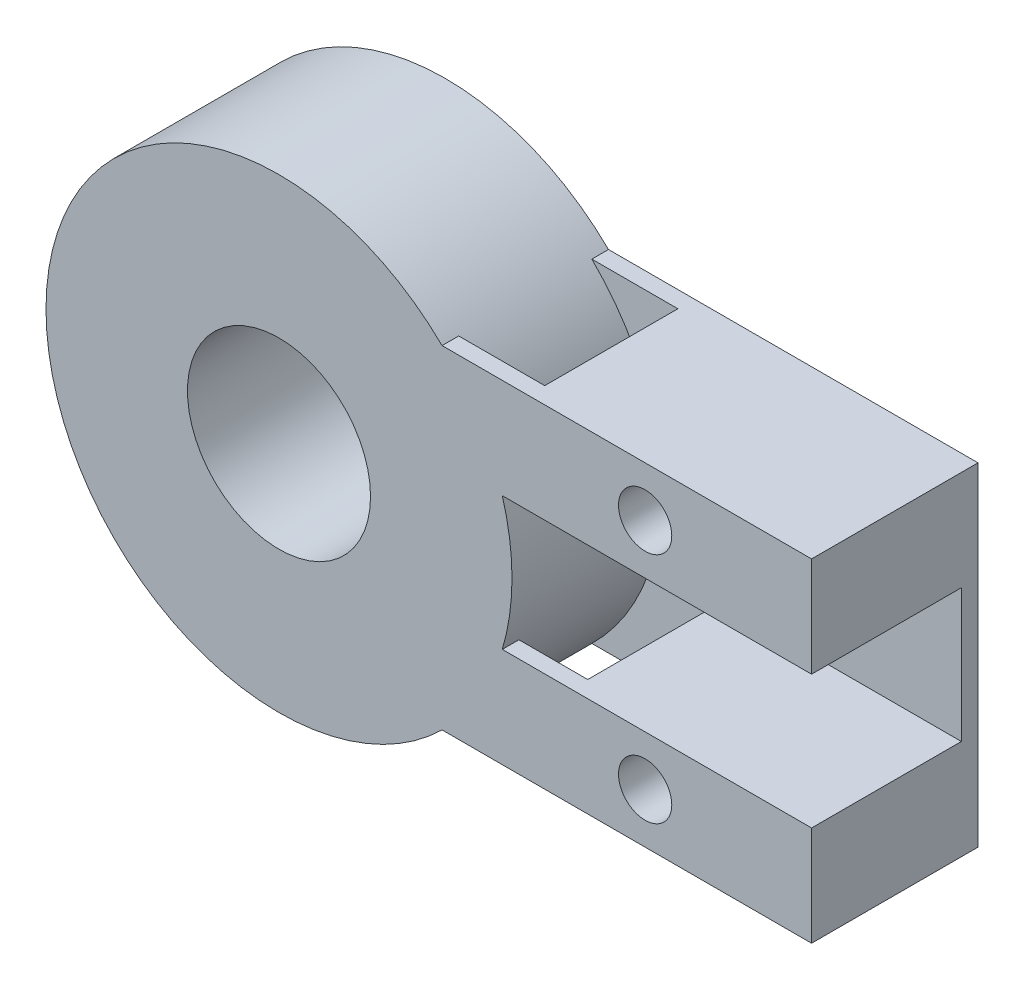
ISO-10303-21;
HEADER;
FILE_DESCRIPTION(('STEP AP214'),'2;1');
FILE_NAME('part.step','',(''),(''),'','','');
FILE_SCHEMA(('AUTOMOTIVE_DESIGN { 1 0 10303 214 1 1 1 1 }'));
ENDSEC;
DATA;
#1=APPLICATION_CONTEXT('core data for automotive mechanical design processes');
#2=APPLICATION_PROTOCOL_DEFINITION('international standard','automotive_design',2000,#1);
#3=PRODUCT_CONTEXT('',#1,'mechanical');
#4=PRODUCT('Part','Part','',(#3));
#5=PRODUCT_RELATED_PRODUCT_CATEGORY('part','',(#4));
#6=PRODUCT_DEFINITION_FORMATION('','',#4);
#7=PRODUCT_DEFINITION_CONTEXT('part definition',#1,'design');
#8=PRODUCT_DEFINITION('design','',#6,#7);
#9=PRODUCT_DEFINITION_SHAPE('','',#8);
#10=(LENGTH_UNIT() NAMED_UNIT(*) SI_UNIT(.MILLI.,.METRE.));
#11=(NAMED_UNIT(*) PLANE_ANGLE_UNIT() SI_UNIT($,.RADIAN.));
#12=(NAMED_UNIT(*) SI_UNIT($,.STERADIAN.) SOLID_ANGLE_UNIT());
#13=UNCERTAINTY_MEASURE_WITH_UNIT(LENGTH_MEASURE(1.E-05),#10,'distance_accuracy_value','');
#14=(GEOMETRIC_REPRESENTATION_CONTEXT(3) GLOBAL_UNCERTAINTY_ASSIGNED_CONTEXT((#13)) GLOBAL_UNIT_ASSIGNED_CONTEXT((#10,
#11,#12)) REPRESENTATION_CONTEXT('',''));
#15=CARTESIAN_POINT('',(0.,0.,0.));
#16=DIRECTION('',(0.,0.,1.));
#17=DIRECTION('',(1.,0.,0.));
#18=AXIS2_PLACEMENT_3D('',#15,#16,#17);
#19=CARTESIAN_POINT('',(6.45608508537583,14.1536682703496,6.));
#20=DIRECTION('',(0.,0.,-1.));
#21=DIRECTION('',(-1.,0.,0.));
#22=AXIS2_PLACEMENT_3D('',#19,#20,#21);
#23=CYLINDRICAL_SURFACE('',#22,9.);
#24=DIRECTION('',(0.,0.,-1.));
#25=VECTOR('',#24,1.);
#26=CARTESIAN_POINT('',(15.231049472768,16.1536682703496,6.));
#27=LINE('',#26,#25);
#28=CARTESIAN_POINT('',(15.231049472768,16.1536682703496,4.5));
#29=VERTEX_POINT('',#28);
#30=CARTESIAN_POINT('',(15.231049472768,16.1536682703496,0.5));
#31=VERTEX_POINT('',#30);
#32=EDGE_CURVE('E214',#29,#31,#27,.T.);
#33=ORIENTED_EDGE('',*,*,#32,.F.);
#34=CARTESIAN_POINT('',(6.45608508537583,14.1536682703496,4.5));
#35=DIRECTION('',(0.,0.,1.));
#36=DIRECTION('',(1.,0.,0.));
#37=AXIS2_PLACEMENT_3D('',#34,#35,#36);
#38=CIRCLE('',#37,9.);
#39=CARTESIAN_POINT('',(13.9393998589237,19.1536682703496,4.5));
#40=VERTEX_POINT('',#39);
#41=EDGE_CURVE('E44',#29,#40,#38,.T.);
#42=ORIENTED_EDGE('',*,*,#41,.T.);
#43=DIRECTION('',(0.,0.,-1.));
#44=VECTOR('',#43,1.);
#45=CARTESIAN_POINT('',(13.9393998589237,19.1536682703496,6.));
#46=LINE('',#45,#44);
#47=CARTESIAN_POINT('',(13.9393998589237,19.1536682703496,0.5));
#48=VERTEX_POINT('',#47);
#49=EDGE_CURVE('E212',#40,#48,#46,.T.);
#50=ORIENTED_EDGE('',*,*,#49,.T.);
#51=CARTESIAN_POINT('',(6.45608508537583,14.1536682703496,0.5));
#52=DIRECTION('',(0.,0.,1.));
#53=DIRECTION('',(1.,0.,0.));
#54=AXIS2_PLACEMENT_3D('',#51,#52,#53);
#55=CIRCLE('',#54,9.);
#56=EDGE_CURVE('E195',#31,#48,#55,.T.);
#57=ORIENTED_EDGE('',*,*,#56,.F.);
#58=EDGE_LOOP('',(#33,#42,#50,#57));
#59=FACE_BOUND('',#58,.T.);
#60=ADVANCED_FACE('F36',(#59),#23,.F.);
#61=CARTESIAN_POINT('',(0.,0.,0.));
#62=DIRECTION('',(0.,0.,1.));
#63=DIRECTION('',(1.,0.,0.));
#64=AXIS2_PLACEMENT_3D('',#61,#62,#63);
#65=PLANE('',#64);
#66=CARTESIAN_POINT('',(17.4560850853758,17.6536682703496,0.));
#67=DIRECTION('',(0.,0.,1.));
#68=DIRECTION('',(1.,0.,0.));
#69=AXIS2_PLACEMENT_3D('',#66,#67,#68);
#70=CIRCLE('',#69,0.800000000000003);
#71=CARTESIAN_POINT('',(18.2560850853758,17.6536682703496,0.));
#72=VERTEX_POINT('',#71);
#73=EDGE_CURVE('E183',#72,#72,#70,.T.);
#74=ORIENTED_EDGE('',*,*,#73,.T.);
#75=EDGE_LOOP('',(#74));
#76=FACE_BOUND('',#75,.T.);
#77=DIRECTION('',(-1.,0.,0.));
#78=VECTOR('',#77,1.);
#79=CARTESIAN_POINT('',(0.,19.1536682703496,0.));
#80=LINE('',#79,#78);
#81=CARTESIAN_POINT('',(22.4560850853758,19.1536682703496,0.));
#82=VERTEX_POINT('',#81);
#83=CARTESIAN_POINT('',(11.3550645709422,19.1536682703496,0.));
#84=VERTEX_POINT('',#83);
#85=EDGE_CURVE('E226',#82,#84,#80,.T.);
#86=ORIENTED_EDGE('',*,*,#85,.F.);
#87=DIRECTION('',(0.,-1.,0.));
#88=VECTOR('',#87,1.);
#89=CARTESIAN_POINT('',(22.4560850853758,0.,0.));
#90=LINE('',#89,#88);
#91=CARTESIAN_POINT('',(22.4560850853758,9.15366827034963,0.));
#92=VERTEX_POINT('',#91);
#93=EDGE_CURVE('E232',#82,#92,#90,.T.);
#94=ORIENTED_EDGE('',*,*,#93,.T.);
#95=DIRECTION('',(-1.,0.,0.));
#96=VECTOR('',#95,1.);
#97=CARTESIAN_POINT('',(0.,9.15366827034963,0.));
#98=LINE('',#97,#96);
#99=CARTESIAN_POINT('',(11.3550645709422,9.15366827034963,0.));
#100=VERTEX_POINT('',#99);
#101=EDGE_CURVE('E246',#92,#100,#98,.T.);
#102=ORIENTED_EDGE('',*,*,#101,.T.);
#103=CARTESIAN_POINT('',(6.45608508537583,14.1536682703496,0.));
#104=DIRECTION('',(0.,0.,1.));
#105=DIRECTION('',(1.,0.,0.));
#106=AXIS2_PLACEMENT_3D('',#103,#104,#105);
#107=CIRCLE('',#106,7.);
#108=EDGE_CURVE('E243',#84,#100,#107,.T.);
#109=ORIENTED_EDGE('',*,*,#108,.F.);
#110=EDGE_LOOP('',(#86,#94,#102,#109));
#111=FACE_BOUND('',#110,.T.);
#112=CARTESIAN_POINT('',(6.45608508537583,14.1536682703496,0.));
#113=DIRECTION('',(0.,0.,1.));
#114=DIRECTION('',(1.,0.,0.));
#115=AXIS2_PLACEMENT_3D('',#112,#113,#114);
#116=CIRCLE('',#115,2.75);
#117=CARTESIAN_POINT('',(9.20608508537583,14.1536682703496,0.));
#118=VERTEX_POINT('',#117);
#119=EDGE_CURVE('E222',#118,#118,#116,.T.);
#120=ORIENTED_EDGE('',*,*,#119,.T.);
#121=EDGE_LOOP('',(#120));
#122=FACE_BOUND('',#121,.T.);
#123=CARTESIAN_POINT('',(17.4560850853758,10.6536682703496,0.));
#124=DIRECTION('',(0.,0.,1.));
#125=DIRECTION('',(1.,0.,0.));
#126=AXIS2_PLACEMENT_3D('',#123,#124,#125);
#127=CIRCLE('',#126,0.799999999999999);
#128=CARTESIAN_POINT('',(18.2560850853758,10.6536682703496,0.));
#129=VERTEX_POINT('',#128);
#130=EDGE_CURVE('E179',#129,#129,#127,.T.);
#131=ORIENTED_EDGE('',*,*,#130,.T.);
#132=EDGE_LOOP('',(#131));
#133=FACE_BOUND('',#132,.T.);
#134=ADVANCED_FACE('F311',(#76,#111,#122,#133),#65,.F.);
#135=CARTESIAN_POINT('',(0.,19.1536682703496,5.));
#136=DIRECTION('',(0.,-1.,0.));
#137=DIRECTION('',(1.,0.,0.));
#138=AXIS2_PLACEMENT_3D('',#135,#136,#137);
#139=PLANE('',#138);
#140=DIRECTION('',(0.,0.,1.));
#141=VECTOR('',#140,1.);
#142=CARTESIAN_POINT('',(11.3550645709422,19.1536682703496,4.5));
#143=LINE('',#142,#141);
#144=CARTESIAN_POINT('',(11.3550645709422,19.1536682703496,4.5));
#145=VERTEX_POINT('',#144);
#146=CARTESIAN_POINT('',(11.3550645709422,19.1536682703496,5.));
#147=VERTEX_POINT('',#146);
#148=EDGE_CURVE('E171',#145,#147,#143,.T.);
#149=ORIENTED_EDGE('',*,*,#148,.T.);
#150=DIRECTION('',(-1.,0.,0.));
#151=VECTOR('',#150,1.);
#152=CARTESIAN_POINT('',(0.,19.1536682703496,5.));
#153=LINE('',#152,#151);
#154=CARTESIAN_POINT('',(22.4560850853758,19.1536682703496,5.));
#155=VERTEX_POINT('',#154);
#156=EDGE_CURVE('E229',#155,#147,#153,.T.);
#157=ORIENTED_EDGE('',*,*,#156,.F.);
#158=DIRECTION('',(0.,0.,-1.));
#159=VECTOR('',#158,1.);
#160=CARTESIAN_POINT('',(22.4560850853758,19.1536682703496,5.));
#161=LINE('',#160,#159);
#162=EDGE_CURVE('E240',#155,#82,#161,.T.);
#163=ORIENTED_EDGE('',*,*,#162,.T.);
#164=ORIENTED_EDGE('',*,*,#85,.T.);
#165=DIRECTION('',(0.,0.,-1.));
#166=VECTOR('',#165,1.);
#167=CARTESIAN_POINT('',(11.3550645709422,19.1536682703496,5.));
#168=LINE('',#167,#166);
#169=CARTESIAN_POINT('',(11.3550645709422,19.1536682703496,0.5));
#170=VERTEX_POINT('',#169);
#171=EDGE_CURVE('E256',#170,#84,#168,.T.);
#172=ORIENTED_EDGE('',*,*,#171,.F.);
#173=DIRECTION('',(1.,0.,0.));
#174=VECTOR('',#173,1.);
#175=CARTESIAN_POINT('',(0.,19.1536682703496,0.5));
#176=LINE('',#175,#174);
#177=EDGE_CURVE('E203',#170,#48,#176,.T.);
#178=ORIENTED_EDGE('',*,*,#177,.T.);
#179=ORIENTED_EDGE('',*,*,#49,.F.);
#180=DIRECTION('',(-1.,0.,0.));
#181=VECTOR('',#180,1.);
#182=CARTESIAN_POINT('',(11.3550645709422,19.1536682703496,4.5));
#183=LINE('',#182,#181);
#184=EDGE_CURVE('E168',#40,#145,#183,.T.);
#185=ORIENTED_EDGE('',*,*,#184,.T.);
#186=EDGE_LOOP('',(#149,#157,#163,#164,#172,#178,#179,#185));
#187=FACE_BOUND('',#186,.T.);
#188=ADVANCED_FACE('F38',(#187),#139,.F.);
#189=CARTESIAN_POINT('',(0.,9.15366827034963,5.));
#190=DIRECTION('',(0.,-1.,0.));
#191=DIRECTION('',(1.,0.,0.));
#192=AXIS2_PLACEMENT_3D('',#189,#190,#191);
#193=PLANE('',#192);
#194=DIRECTION('',(-1.,0.,0.));
#195=VECTOR('',#194,1.);
#196=CARTESIAN_POINT('',(0.,9.15366827034963,5.));
#197=LINE('',#196,#195);
#198=CARTESIAN_POINT('',(22.4560850853758,9.15366827034963,5.));
#199=VERTEX_POINT('',#198);
#200=CARTESIAN_POINT('',(11.3550645709422,9.15366827034963,5.));
#201=VERTEX_POINT('',#200);
#202=EDGE_CURVE('E143',#199,#201,#197,.T.);
#203=ORIENTED_EDGE('',*,*,#202,.T.);
#204=DIRECTION('',(0.,0.,1.));
#205=VECTOR('',#204,1.);
#206=CARTESIAN_POINT('',(11.3550645709422,9.15366827034963,4.5));
#207=LINE('',#206,#205);
#208=CARTESIAN_POINT('',(11.3550645709422,9.15366827034963,4.5));
#209=VERTEX_POINT('',#208);
#210=EDGE_CURVE('E137',#209,#201,#207,.T.);
#211=ORIENTED_EDGE('',*,*,#210,.F.);
#212=DIRECTION('',(1.,0.,0.));
#213=VECTOR('',#212,1.);
#214=CARTESIAN_POINT('',(11.3550645709422,9.15366827034963,4.5));
#215=LINE('',#214,#213);
#216=CARTESIAN_POINT('',(13.9393998589237,9.15366827034963,4.5));
#217=VERTEX_POINT('',#216);
#218=EDGE_CURVE('E140',#209,#217,#215,.T.);
#219=ORIENTED_EDGE('',*,*,#218,.T.);
#220=DIRECTION('',(0.,0.,-1.));
#221=VECTOR('',#220,1.);
#222=CARTESIAN_POINT('',(13.9393998589237,9.15366827034963,6.));
#223=LINE('',#222,#221);
#224=CARTESIAN_POINT('',(13.9393998589237,9.15366827034963,0.5));
#225=VERTEX_POINT('',#224);
#226=EDGE_CURVE('E59',#217,#225,#223,.T.);
#227=ORIENTED_EDGE('',*,*,#226,.T.);
#228=DIRECTION('',(1.,0.,0.));
#229=VECTOR('',#228,1.);
#230=CARTESIAN_POINT('',(0.,9.15366827034963,0.5));
#231=LINE('',#230,#229);
#232=CARTESIAN_POINT('',(11.3550645709422,9.15366827034963,0.5));
#233=VERTEX_POINT('',#232);
#234=EDGE_CURVE('E209',#233,#225,#231,.T.);
#235=ORIENTED_EDGE('',*,*,#234,.F.);
#236=DIRECTION('',(0.,0.,-1.));
#237=VECTOR('',#236,1.);
#238=CARTESIAN_POINT('',(11.3550645709422,9.15366827034963,5.));
#239=LINE('',#238,#237);
#240=EDGE_CURVE('E254',#233,#100,#239,.T.);
#241=ORIENTED_EDGE('',*,*,#240,.T.);
#242=ORIENTED_EDGE('',*,*,#101,.F.);
#243=DIRECTION('',(0.,0.,-1.));
#244=VECTOR('',#243,1.);
#245=CARTESIAN_POINT('',(22.4560850853758,9.15366827034963,5.));
#246=LINE('',#245,#244);
#247=EDGE_CURVE('E252',#199,#92,#246,.T.);
#248=ORIENTED_EDGE('',*,*,#247,.F.);
#249=EDGE_LOOP('',(#203,#211,#219,#227,#235,#241,#242,#248));
#250=FACE_BOUND('',#249,.T.);
#251=ADVANCED_FACE('F139',(#250),#193,.T.);
#252=CARTESIAN_POINT('',(0.,0.,5.));
#253=DIRECTION('',(0.,0.,1.));
#254=DIRECTION('',(1.,0.,0.));
#255=AXIS2_PLACEMENT_3D('',#252,#253,#254);
#256=PLANE('',#255);
#257=CARTESIAN_POINT('',(6.45608508537583,14.1536682703496,5.));
#258=DIRECTION('',(0.,0.,1.));
#259=DIRECTION('',(1.,0.,0.));
#260=AXIS2_PLACEMENT_3D('',#257,#258,#259);
#261=CIRCLE('',#260,7.);
#262=EDGE_CURVE('E233',#147,#201,#261,.T.);
#263=ORIENTED_EDGE('',*,*,#262,.T.);
#264=ORIENTED_EDGE('',*,*,#202,.F.);
#265=DIRECTION('',(0.,-1.,0.));
#266=VECTOR('',#265,1.);
#267=CARTESIAN_POINT('',(22.4560850853758,0.,5.));
#268=LINE('',#267,#266);
#269=CARTESIAN_POINT('',(22.4560850853758,12.1536682703496,5.));
#270=VERTEX_POINT('',#269);
#271=EDGE_CURVE('E236',#270,#199,#268,.T.);
#272=ORIENTED_EDGE('',*,*,#271,.F.);
#273=DIRECTION('',(1.,0.,0.));
#274=VECTOR('',#273,1.);
#275=CARTESIAN_POINT('',(0.,12.1536682703496,5.));
#276=LINE('',#275,#274);
#277=CARTESIAN_POINT('',(13.1642890178752,12.1536682703496,5.));
#278=VERTEX_POINT('',#277);
#279=EDGE_CURVE('E51',#278,#270,#276,.T.);
#280=ORIENTED_EDGE('',*,*,#279,.F.);
#281=CARTESIAN_POINT('',(13.1642890178752,16.1536682703496,5.));
#282=VERTEX_POINT('',#281);
#283=EDGE_CURVE('E231',#278,#282,#261,.T.);
#284=ORIENTED_EDGE('',*,*,#283,.T.);
#285=DIRECTION('',(1.,0.,0.));
#286=VECTOR('',#285,1.);
#287=CARTESIAN_POINT('',(0.,16.1536682703496,5.));
#288=LINE('',#287,#286);
#289=CARTESIAN_POINT('',(22.4560850853758,16.1536682703496,5.));
#290=VERTEX_POINT('',#289);
#291=EDGE_CURVE('E218',#282,#290,#288,.T.);
#292=ORIENTED_EDGE('',*,*,#291,.T.);
#293=EDGE_CURVE('E237',#155,#290,#268,.T.);
#294=ORIENTED_EDGE('',*,*,#293,.F.);
#295=ORIENTED_EDGE('',*,*,#156,.T.);
#296=EDGE_LOOP('',(#263,#264,#272,#280,#284,#292,#294,#295));
#297=FACE_BOUND('',#296,.T.);
#298=CARTESIAN_POINT('',(6.45608508537583,14.1536682703496,5.));
#299=DIRECTION('',(0.,0.,1.));
#300=DIRECTION('',(1.,0.,0.));
#301=AXIS2_PLACEMENT_3D('',#298,#299,#300);
#302=CIRCLE('',#301,2.75);
#303=CARTESIAN_POINT('',(9.20608508537583,14.1536682703496,5.));
#304=VERTEX_POINT('',#303);
#305=EDGE_CURVE('E223',#304,#304,#302,.T.);
#306=ORIENTED_EDGE('',*,*,#305,.F.);
#307=EDGE_LOOP('',(#306));
#308=FACE_BOUND('',#307,.T.);
#309=CARTESIAN_POINT('',(17.4560850853758,17.6536682703496,5.));
#310=DIRECTION('',(0.,0.,1.));
#311=DIRECTION('',(1.,0.,0.));
#312=AXIS2_PLACEMENT_3D('',#309,#310,#311);
#313=CIRCLE('',#312,0.800000000000003);
#314=CARTESIAN_POINT('',(18.2560850853758,17.6536682703496,5.));
#315=VERTEX_POINT('',#314);
#316=EDGE_CURVE('E186',#315,#315,#313,.T.);
#317=ORIENTED_EDGE('',*,*,#316,.F.);
#318=EDGE_LOOP('',(#317));
#319=FACE_BOUND('',#318,.T.);
#320=CARTESIAN_POINT('',(17.4560850853758,10.6536682703496,5.));
#321=DIRECTION('',(0.,0.,1.));
#322=DIRECTION('',(1.,0.,0.));
#323=AXIS2_PLACEMENT_3D('',#320,#321,#322);
#324=CIRCLE('',#323,0.799999999999999);
#325=CARTESIAN_POINT('',(18.2560850853758,10.6536682703496,5.));
#326=VERTEX_POINT('',#325);
#327=EDGE_CURVE('E180',#326,#326,#324,.T.);
#328=ORIENTED_EDGE('',*,*,#327,.F.);
#329=EDGE_LOOP('',(#328));
#330=FACE_BOUND('',#329,.T.);
#331=ADVANCED_FACE('F295',(#297,#308,#319,#330),#256,.T.);
#332=CARTESIAN_POINT('',(6.45608508537583,14.1536682703496,5.));
#333=DIRECTION('',(0.,0.,-1.));
#334=DIRECTION('',(-1.,0.,0.));
#335=AXIS2_PLACEMENT_3D('',#332,#333,#334);
#336=CYLINDRICAL_SURFACE('',#335,7.);
#337=ORIENTED_EDGE('',*,*,#283,.F.);
#338=DIRECTION('',(0.,0.,-1.));
#339=VECTOR('',#338,1.);
#340=CARTESIAN_POINT('',(13.1642890178752,12.1536682703496,5.));
#341=LINE('',#340,#339);
#342=CARTESIAN_POINT('',(13.1642890178752,12.1536682703496,4.5));
#343=VERTEX_POINT('',#342);
#344=EDGE_CURVE('E160',#278,#343,#341,.T.);
#345=ORIENTED_EDGE('',*,*,#344,.T.);
#346=CARTESIAN_POINT('',(6.45608508537583,14.1536682703496,4.5));
#347=DIRECTION('',(0.,0.,-1.));
#348=DIRECTION('',(-1.,0.,0.));
#349=AXIS2_PLACEMENT_3D('',#346,#347,#348);
#350=CIRCLE('',#349,7.);
#351=EDGE_CURVE('E148',#343,#209,#350,.T.);
#352=ORIENTED_EDGE('',*,*,#351,.T.);
#353=ORIENTED_EDGE('',*,*,#210,.T.);
#354=ORIENTED_EDGE('',*,*,#262,.F.);
#355=ORIENTED_EDGE('',*,*,#148,.F.);
#356=CARTESIAN_POINT('',(6.45608508537583,14.1536682703496,4.5));
#357=DIRECTION('',(0.,0.,1.));
#358=DIRECTION('',(1.,0.,0.));
#359=AXIS2_PLACEMENT_3D('',#356,#357,#358);
#360=CIRCLE('',#359,7.);
#361=CARTESIAN_POINT('',(13.1642890178752,16.1536682703496,4.5));
#362=VERTEX_POINT('',#361);
#363=EDGE_CURVE('E174',#362,#145,#360,.T.);
#364=ORIENTED_EDGE('',*,*,#363,.F.);
#365=DIRECTION('',(0.,0.,-1.));
#366=VECTOR('',#365,1.);
#367=CARTESIAN_POINT('',(13.1642890178752,16.1536682703496,5.));
#368=LINE('',#367,#366);
#369=EDGE_CURVE('E176',#362,#282,#368,.F.);
#370=ORIENTED_EDGE('',*,*,#369,.T.);
#371=EDGE_LOOP('',(#337,#345,#352,#353,#354,#355,#364,#370));
#372=FACE_BOUND('',#371,.T.);
#373=CARTESIAN_POINT('',(6.45608508537583,14.1536682703496,0.5));
#374=DIRECTION('',(0.,0.,1.));
#375=DIRECTION('',(1.,0.,0.));
#376=AXIS2_PLACEMENT_3D('',#373,#374,#375);
#377=CIRCLE('',#376,7.);
#378=EDGE_CURVE('E206',#233,#170,#377,.T.);
#379=ORIENTED_EDGE('',*,*,#378,.T.);
#380=ORIENTED_EDGE('',*,*,#171,.T.);
#381=ORIENTED_EDGE('',*,*,#108,.T.);
#382=ORIENTED_EDGE('',*,*,#240,.F.);
#383=EDGE_LOOP('',(#379,#380,#381,#382));
#384=FACE_BOUND('',#383,.T.);
#385=ADVANCED_FACE('F158',(#372,#384),#336,.T.);
#386=CARTESIAN_POINT('',(22.4560850853758,0.,5.));
#387=DIRECTION('',(1.,0.,0.));
#388=DIRECTION('',(0.,1.,0.));
#389=AXIS2_PLACEMENT_3D('',#386,#387,#388);
#390=PLANE('',#389);
#391=DIRECTION('',(0.,0.,-1.));
#392=VECTOR('',#391,1.);
#393=CARTESIAN_POINT('',(22.4560850853758,12.1536682703496,5.));
#394=LINE('',#393,#392);
#395=CARTESIAN_POINT('',(22.4560850853758,12.1536682703496,0.5));
#396=VERTEX_POINT('',#395);
#397=EDGE_CURVE('E261',#270,#396,#394,.T.);
#398=ORIENTED_EDGE('',*,*,#397,.F.);
#399=ORIENTED_EDGE('',*,*,#271,.T.);
#400=ORIENTED_EDGE('',*,*,#247,.T.);
#401=ORIENTED_EDGE('',*,*,#93,.F.);
#402=ORIENTED_EDGE('',*,*,#162,.F.);
#403=ORIENTED_EDGE('',*,*,#293,.T.);
#404=DIRECTION('',(0.,0.,-1.));
#405=VECTOR('',#404,1.);
#406=CARTESIAN_POINT('',(22.4560850853758,16.1536682703496,5.));
#407=LINE('',#406,#405);
#408=CARTESIAN_POINT('',(22.4560850853758,16.1536682703496,0.5));
#409=VERTEX_POINT('',#408);
#410=EDGE_CURVE('E258',#290,#409,#407,.T.);
#411=ORIENTED_EDGE('',*,*,#410,.T.);
#412=DIRECTION('',(0.,1.,0.));
#413=VECTOR('',#412,1.);
#414=CARTESIAN_POINT('',(22.4560850853758,0.,0.5));
#415=LINE('',#414,#413);
#416=EDGE_CURVE('E198',#396,#409,#415,.T.);
#417=ORIENTED_EDGE('',*,*,#416,.F.);
#418=EDGE_LOOP('',(#398,#399,#400,#401,#402,#403,#411,#417));
#419=FACE_BOUND('',#418,.T.);
#420=ADVANCED_FACE('F291',(#419),#390,.T.);
#421=CARTESIAN_POINT('',(6.45608508537583,14.1536682703496,5.));
#422=DIRECTION('',(0.,0.,-1.));
#423=DIRECTION('',(-1.,0.,0.));
#424=AXIS2_PLACEMENT_3D('',#421,#422,#423);
#425=CYLINDRICAL_SURFACE('',#424,2.75);
#426=ORIENTED_EDGE('',*,*,#305,.T.);
#427=EDGE_LOOP('',(#426));
#428=FACE_BOUND('',#427,.T.);
#429=ORIENTED_EDGE('',*,*,#119,.F.);
#430=EDGE_LOOP('',(#429));
#431=FACE_BOUND('',#430,.T.);
#432=ADVANCED_FACE('F321',(#428,#431),#425,.F.);
#433=CARTESIAN_POINT('',(6.45608508537583,14.1536682703496,4.5));
#434=DIRECTION('',(0.,0.,-1.));
#435=DIRECTION('',(-1.,0.,0.));
#436=AXIS2_PLACEMENT_3D('',#433,#434,#435);
#437=CIRCLE('',#436,9.);
#438=CARTESIAN_POINT('',(15.231049472768,12.1536682703496,4.5));
#439=VERTEX_POINT('',#438);
#440=EDGE_CURVE('E11',#439,#217,#437,.T.);
#441=ORIENTED_EDGE('',*,*,#440,.F.);
#442=DIRECTION('',(0.,0.,-1.));
#443=VECTOR('',#442,1.);
#444=CARTESIAN_POINT('',(15.231049472768,12.1536682703496,6.));
#445=LINE('',#444,#443);
#446=CARTESIAN_POINT('',(15.231049472768,12.1536682703496,0.5));
#447=VERTEX_POINT('',#446);
#448=EDGE_CURVE('E216',#439,#447,#445,.T.);
#449=ORIENTED_EDGE('',*,*,#448,.T.);
#450=EDGE_CURVE('E189',#225,#447,#55,.T.);
#451=ORIENTED_EDGE('',*,*,#450,.F.);
#452=ORIENTED_EDGE('',*,*,#226,.F.);
#453=EDGE_LOOP('',(#441,#449,#451,#452));
#454=FACE_BOUND('',#453,.T.);
#455=ADVANCED_FACE('F281',(#454),#23,.F.);
#456=CARTESIAN_POINT('',(0.,12.1536682703496,6.));
#457=DIRECTION('',(0.,-1.,0.));
#458=DIRECTION('',(1.,0.,0.));
#459=AXIS2_PLACEMENT_3D('',#456,#457,#458);
#460=PLANE('',#459);
#461=ORIENTED_EDGE('',*,*,#279,.T.);
#462=ORIENTED_EDGE('',*,*,#397,.T.);
#463=DIRECTION('',(-1.,0.,0.));
#464=VECTOR('',#463,1.);
#465=CARTESIAN_POINT('',(0.,12.1536682703496,0.5));
#466=LINE('',#465,#464);
#467=EDGE_CURVE('E194',#396,#447,#466,.T.);
#468=ORIENTED_EDGE('',*,*,#467,.T.);
#469=ORIENTED_EDGE('',*,*,#448,.F.);
#470=DIRECTION('',(-1.,0.,0.));
#471=VECTOR('',#470,1.);
#472=CARTESIAN_POINT('',(11.3550645709422,12.1536682703496,4.5));
#473=LINE('',#472,#471);
#474=EDGE_CURVE('E149',#439,#343,#473,.T.);
#475=ORIENTED_EDGE('',*,*,#474,.T.);
#476=ORIENTED_EDGE('',*,*,#344,.F.);
#477=EDGE_LOOP('',(#461,#462,#468,#469,#475,#476));
#478=FACE_BOUND('',#477,.T.);
#479=ADVANCED_FACE('F283',(#478),#460,.F.);
#480=CARTESIAN_POINT('',(0.,16.1536682703496,6.));
#481=DIRECTION('',(0.,-1.,0.));
#482=DIRECTION('',(0.,0.,-1.));
#483=AXIS2_PLACEMENT_3D('',#480,#481,#482);
#484=PLANE('',#483);
#485=ORIENTED_EDGE('',*,*,#291,.F.);
#486=ORIENTED_EDGE('',*,*,#369,.F.);
#487=DIRECTION('',(1.,0.,0.));
#488=VECTOR('',#487,1.);
#489=CARTESIAN_POINT('',(11.3550645709422,16.1536682703496,4.5));
#490=LINE('',#489,#488);
#491=EDGE_CURVE('E162',#362,#29,#490,.T.);
#492=ORIENTED_EDGE('',*,*,#491,.T.);
#493=ORIENTED_EDGE('',*,*,#32,.T.);
#494=DIRECTION('',(-1.,0.,0.));
#495=VECTOR('',#494,1.);
#496=CARTESIAN_POINT('',(0.,16.1536682703496,0.5));
#497=LINE('',#496,#495);
#498=EDGE_CURVE('E200',#409,#31,#497,.T.);
#499=ORIENTED_EDGE('',*,*,#498,.F.);
#500=ORIENTED_EDGE('',*,*,#410,.F.);
#501=EDGE_LOOP('',(#485,#486,#492,#493,#499,#500));
#502=FACE_BOUND('',#501,.T.);
#503=ADVANCED_FACE('F290',(#502),#484,.T.);
#504=CARTESIAN_POINT('',(0.,0.,0.5));
#505=DIRECTION('',(0.,0.,1.));
#506=DIRECTION('',(1.,0.,0.));
#507=AXIS2_PLACEMENT_3D('',#504,#505,#506);
#508=PLANE('',#507);
#509=ORIENTED_EDGE('',*,*,#450,.T.);
#510=ORIENTED_EDGE('',*,*,#467,.F.);
#511=ORIENTED_EDGE('',*,*,#416,.T.);
#512=ORIENTED_EDGE('',*,*,#498,.T.);
#513=ORIENTED_EDGE('',*,*,#56,.T.);
#514=ORIENTED_EDGE('',*,*,#177,.F.);
#515=ORIENTED_EDGE('',*,*,#378,.F.);
#516=ORIENTED_EDGE('',*,*,#234,.T.);
#517=EDGE_LOOP('',(#509,#510,#511,#512,#513,#514,#515,#516));
#518=FACE_BOUND('',#517,.T.);
#519=ADVANCED_FACE('F276',(#518),#508,.T.);
#520=CARTESIAN_POINT('',(17.4560850853758,17.6536682703496,5.));
#521=DIRECTION('',(0.,0.,-1.));
#522=DIRECTION('',(-1.,0.,0.));
#523=AXIS2_PLACEMENT_3D('',#520,#521,#522);
#524=CYLINDRICAL_SURFACE('',#523,0.800000000000003);
#525=ORIENTED_EDGE('',*,*,#316,.T.);
#526=EDGE_LOOP('',(#525));
#527=FACE_BOUND('',#526,.T.);
#528=ORIENTED_EDGE('',*,*,#73,.F.);
#529=EDGE_LOOP('',(#528));
#530=FACE_BOUND('',#529,.T.);
#531=ADVANCED_FACE('F307',(#527,#530),#524,.F.);
#532=CARTESIAN_POINT('',(17.4560850853758,10.6536682703496,5.));
#533=DIRECTION('',(0.,0.,-1.));
#534=DIRECTION('',(-1.,0.,0.));
#535=AXIS2_PLACEMENT_3D('',#532,#533,#534);
#536=CYLINDRICAL_SURFACE('',#535,0.799999999999999);
#537=ORIENTED_EDGE('',*,*,#327,.T.);
#538=EDGE_LOOP('',(#537));
#539=FACE_BOUND('',#538,.T.);
#540=ORIENTED_EDGE('',*,*,#130,.F.);
#541=EDGE_LOOP('',(#540));
#542=FACE_BOUND('',#541,.T.);
#543=ADVANCED_FACE('F300',(#539,#542),#536,.F.);
#544=CARTESIAN_POINT('',(0.,0.,4.5));
#545=DIRECTION('',(0.,0.,1.));
#546=DIRECTION('',(1.,0.,0.));
#547=AXIS2_PLACEMENT_3D('',#544,#545,#546);
#548=PLANE('',#547);
#549=ORIENTED_EDGE('',*,*,#491,.F.);
#550=ORIENTED_EDGE('',*,*,#363,.T.);
#551=ORIENTED_EDGE('',*,*,#184,.F.);
#552=ORIENTED_EDGE('',*,*,#41,.F.);
#553=EDGE_LOOP('',(#549,#550,#551,#552));
#554=FACE_BOUND('',#553,.T.);
#555=ADVANCED_FACE('F298',(#554),#548,.F.);
#556=CARTESIAN_POINT('',(0.,0.,4.5));
#557=DIRECTION('',(0.,0.,-1.));
#558=DIRECTION('',(-1.,0.,0.));
#559=AXIS2_PLACEMENT_3D('',#556,#557,#558);
#560=PLANE('',#559);
#561=ORIENTED_EDGE('',*,*,#351,.F.);
#562=ORIENTED_EDGE('',*,*,#474,.F.);
#563=ORIENTED_EDGE('',*,*,#440,.T.);
#564=ORIENTED_EDGE('',*,*,#218,.F.);
#565=EDGE_LOOP('',(#561,#562,#563,#564));
#566=FACE_BOUND('',#565,.T.);
#567=ADVANCED_FACE('F152',(#566),#560,.T.);
#568=CLOSED_SHELL('',(#60,#134,#188,#251,#331,#385,#420,#432,#455,#479,#503,#519,#531,#543,#555,#567));
#569=MANIFOLD_SOLID_BREP('B2',#568);
#570=ADVANCED_BREP_SHAPE_REPRESENTATION('',(#18,#569),#14);
#571=SHAPE_DEFINITION_REPRESENTATION(#9,#570);
ENDSEC;
END-ISO-10303-21;
